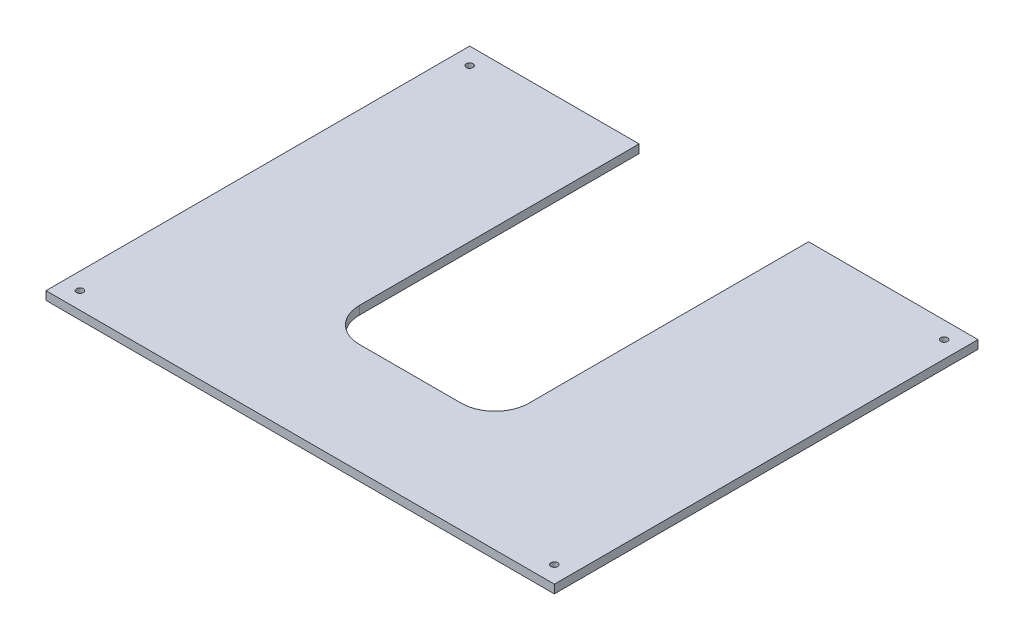
ISO-10303-21;
HEADER;
FILE_DESCRIPTION(('STEP AP214'),'2;1');
FILE_NAME('part.step','',(''),(''),'','','');
FILE_SCHEMA(('AUTOMOTIVE_DESIGN { 1 0 10303 214 1 1 1 1 }'));
ENDSEC;
DATA;
#1=APPLICATION_CONTEXT('core data for automotive mechanical design processes');
#2=APPLICATION_PROTOCOL_DEFINITION('international standard','automotive_design',2000,#1);
#3=PRODUCT_CONTEXT('',#1,'mechanical');
#4=PRODUCT('Part','Part','',(#3));
#5=PRODUCT_RELATED_PRODUCT_CATEGORY('part','',(#4));
#6=PRODUCT_DEFINITION_FORMATION('','',#4);
#7=PRODUCT_DEFINITION_CONTEXT('part definition',#1,'design');
#8=PRODUCT_DEFINITION('design','',#6,#7);
#9=PRODUCT_DEFINITION_SHAPE('','',#8);
#10=(LENGTH_UNIT() NAMED_UNIT(*) SI_UNIT(.MILLI.,.METRE.));
#11=(NAMED_UNIT(*) PLANE_ANGLE_UNIT() SI_UNIT($,.RADIAN.));
#12=(NAMED_UNIT(*) SI_UNIT($,.STERADIAN.) SOLID_ANGLE_UNIT());
#13=UNCERTAINTY_MEASURE_WITH_UNIT(LENGTH_MEASURE(1.E-05),#10,'distance_accuracy_value','');
#14=(GEOMETRIC_REPRESENTATION_CONTEXT(3) GLOBAL_UNCERTAINTY_ASSIGNED_CONTEXT((#13)) GLOBAL_UNIT_ASSIGNED_CONTEXT((#10,
#11,#12)) REPRESENTATION_CONTEXT('',''));
#15=CARTESIAN_POINT('',(0.,0.,0.));
#16=DIRECTION('',(0.,0.,1.));
#17=DIRECTION('',(1.,0.,0.));
#18=AXIS2_PLACEMENT_3D('',#15,#16,#17);
#19=CARTESIAN_POINT('',(-150.,5.,-125.));
#20=DIRECTION('',(0.,0.,1.));
#21=DIRECTION('',(1.,0.,0.));
#22=AXIS2_PLACEMENT_3D('',#19,#20,#21);
#23=PLANE('',#22);
#24=DIRECTION('',(-1.,0.,0.));
#25=VECTOR('',#24,1.);
#26=CARTESIAN_POINT('',(-150.,5.,-125.));
#27=LINE('',#26,#25);
#28=CARTESIAN_POINT('',(-50.,5.,-125.));
#29=VERTEX_POINT('',#28);
#30=CARTESIAN_POINT('',(-150.,5.,-125.));
#31=VERTEX_POINT('',#30);
#32=EDGE_CURVE('E202',#29,#31,#27,.T.);
#33=ORIENTED_EDGE('',*,*,#32,.F.);
#34=DIRECTION('',(0.,1.,0.));
#35=VECTOR('',#34,1.);
#36=CARTESIAN_POINT('',(-50.,0.,-125.));
#37=LINE('',#36,#35);
#38=CARTESIAN_POINT('',(-50.,0.,-125.));
#39=VERTEX_POINT('',#38);
#40=EDGE_CURVE('E139',#39,#29,#37,.T.);
#41=ORIENTED_EDGE('',*,*,#40,.F.);
#42=DIRECTION('',(-1.,0.,0.));
#43=VECTOR('',#42,1.);
#44=CARTESIAN_POINT('',(-150.,0.,-125.));
#45=LINE('',#44,#43);
#46=CARTESIAN_POINT('',(-150.,0.,-125.));
#47=VERTEX_POINT('',#46);
#48=EDGE_CURVE('E146',#39,#47,#45,.T.);
#49=ORIENTED_EDGE('',*,*,#48,.T.);
#50=DIRECTION('',(0.,-1.,0.));
#51=VECTOR('',#50,1.);
#52=CARTESIAN_POINT('',(-150.,5.,-125.));
#53=LINE('',#52,#51);
#54=EDGE_CURVE('E163',#31,#47,#53,.T.);
#55=ORIENTED_EDGE('',*,*,#54,.F.);
#56=EDGE_LOOP('',(#33,#41,#49,#55));
#57=FACE_BOUND('',#56,.T.);
#58=ADVANCED_FACE('F41',(#57),#23,.F.);
#59=CARTESIAN_POINT('',(0.,5.,0.));
#60=DIRECTION('',(0.,-1.,0.));
#61=DIRECTION('',(0.,0.,-1.));
#62=AXIS2_PLACEMENT_3D('',#59,#60,#61);
#63=PLANE('',#62);
#64=DIRECTION('',(1.,0.,0.));
#65=VECTOR('',#64,1.);
#66=CARTESIAN_POINT('',(-50.,5.,60.));
#67=LINE('',#66,#65);
#68=CARTESIAN_POINT('',(-30.,5.,60.));
#69=VERTEX_POINT('',#68);
#70=CARTESIAN_POINT('',(30.,5.,60.));
#71=VERTEX_POINT('',#70);
#72=EDGE_CURVE('E249',#69,#71,#67,.T.);
#73=ORIENTED_EDGE('',*,*,#72,.F.);
#74=CARTESIAN_POINT('',(-30.,5.,40.));
#75=DIRECTION('',(0.,-1.,0.));
#76=DIRECTION('',(0.,0.,-1.));
#77=AXIS2_PLACEMENT_3D('',#74,#75,#76);
#78=CIRCLE('',#77,20.);
#79=CARTESIAN_POINT('',(-50.,5.,40.));
#80=VERTEX_POINT('',#79);
#81=EDGE_CURVE('E49',#69,#80,#78,.T.);
#82=ORIENTED_EDGE('',*,*,#81,.T.);
#83=DIRECTION('',(0.,0.,1.));
#84=VECTOR('',#83,1.);
#85=CARTESIAN_POINT('',(-50.,5.,-125.));
#86=LINE('',#85,#84);
#87=EDGE_CURVE('E225',#29,#80,#86,.T.);
#88=ORIENTED_EDGE('',*,*,#87,.F.);
#89=ORIENTED_EDGE('',*,*,#32,.T.);
#90=DIRECTION('',(0.,0.,1.));
#91=VECTOR('',#90,1.);
#92=CARTESIAN_POINT('',(-150.,5.,125.));
#93=LINE('',#92,#91);
#94=CARTESIAN_POINT('',(-150.,5.,125.));
#95=VERTEX_POINT('',#94);
#96=EDGE_CURVE('E212',#31,#95,#93,.T.);
#97=ORIENTED_EDGE('',*,*,#96,.T.);
#98=DIRECTION('',(1.,0.,0.));
#99=VECTOR('',#98,1.);
#100=CARTESIAN_POINT('',(-150.,5.,125.));
#101=LINE('',#100,#99);
#102=CARTESIAN_POINT('',(150.,5.,125.));
#103=VERTEX_POINT('',#102);
#104=EDGE_CURVE('E160',#95,#103,#101,.T.);
#105=ORIENTED_EDGE('',*,*,#104,.T.);
#106=DIRECTION('',(0.,0.,-1.));
#107=VECTOR('',#106,1.);
#108=CARTESIAN_POINT('',(150.,5.,125.));
#109=LINE('',#108,#107);
#110=CARTESIAN_POINT('',(150.,5.,-125.));
#111=VERTEX_POINT('',#110);
#112=EDGE_CURVE('E155',#103,#111,#109,.T.);
#113=ORIENTED_EDGE('',*,*,#112,.T.);
#114=CARTESIAN_POINT('',(50.,5.,-125.));
#115=VERTEX_POINT('',#114);
#116=EDGE_CURVE('E203',#111,#115,#27,.T.);
#117=ORIENTED_EDGE('',*,*,#116,.T.);
#118=DIRECTION('',(0.,0.,-1.));
#119=VECTOR('',#118,1.);
#120=CARTESIAN_POINT('',(50.,5.,-125.));
#121=LINE('',#120,#119);
#122=CARTESIAN_POINT('',(50.,5.,40.));
#123=VERTEX_POINT('',#122);
#124=EDGE_CURVE('E136',#123,#115,#121,.T.);
#125=ORIENTED_EDGE('',*,*,#124,.F.);
#126=CARTESIAN_POINT('',(30.,5.,40.));
#127=DIRECTION('',(0.,-1.,0.));
#128=DIRECTION('',(0.,0.,-1.));
#129=AXIS2_PLACEMENT_3D('',#126,#127,#128);
#130=CIRCLE('',#129,20.);
#131=EDGE_CURVE('E175',#123,#71,#130,.T.);
#132=ORIENTED_EDGE('',*,*,#131,.T.);
#133=EDGE_LOOP('',(#73,#82,#88,#89,#97,#105,#113,#117,#125,#132));
#134=FACE_BOUND('',#133,.T.);
#135=CARTESIAN_POINT('',(-140.,5.,115.));
#136=DIRECTION('',(0.,1.,0.));
#137=DIRECTION('',(0.,0.,1.));
#138=AXIS2_PLACEMENT_3D('',#135,#136,#137);
#139=CIRCLE('',#138,2.);
#140=CARTESIAN_POINT('',(-140.,5.,117.));
#141=VERTEX_POINT('',#140);
#142=EDGE_CURVE('E187',#141,#141,#139,.T.);
#143=ORIENTED_EDGE('',*,*,#142,.F.);
#144=EDGE_LOOP('',(#143));
#145=FACE_BOUND('',#144,.T.);
#146=CARTESIAN_POINT('',(-140.,5.,-115.));
#147=DIRECTION('',(0.,1.,0.));
#148=DIRECTION('',(0.,0.,-1.));
#149=AXIS2_PLACEMENT_3D('',#146,#147,#148);
#150=CIRCLE('',#149,2.);
#151=CARTESIAN_POINT('',(-140.,5.,-117.));
#152=VERTEX_POINT('',#151);
#153=EDGE_CURVE('E197',#152,#152,#150,.T.);
#154=ORIENTED_EDGE('',*,*,#153,.F.);
#155=EDGE_LOOP('',(#154));
#156=FACE_BOUND('',#155,.T.);
#157=CARTESIAN_POINT('',(140.,5.,115.));
#158=DIRECTION('',(0.,1.,0.));
#159=DIRECTION('',(0.,0.,-1.));
#160=AXIS2_PLACEMENT_3D('',#157,#158,#159);
#161=CIRCLE('',#160,2.);
#162=CARTESIAN_POINT('',(140.,5.,113.));
#163=VERTEX_POINT('',#162);
#164=EDGE_CURVE('E272',#163,#163,#161,.T.);
#165=ORIENTED_EDGE('',*,*,#164,.F.);
#166=EDGE_LOOP('',(#165));
#167=FACE_BOUND('',#166,.T.);
#168=CARTESIAN_POINT('',(140.,5.,-115.));
#169=DIRECTION('',(0.,1.,0.));
#170=DIRECTION('',(0.,0.,1.));
#171=AXIS2_PLACEMENT_3D('',#168,#169,#170);
#172=CIRCLE('',#171,2.);
#173=CARTESIAN_POINT('',(140.,5.,-113.));
#174=VERTEX_POINT('',#173);
#175=EDGE_CURVE('E264',#174,#174,#172,.T.);
#176=ORIENTED_EDGE('',*,*,#175,.F.);
#177=EDGE_LOOP('',(#176));
#178=FACE_BOUND('',#177,.T.);
#179=ADVANCED_FACE('F223',(#134,#145,#156,#167,#178),#63,.F.);
#180=CARTESIAN_POINT('',(0.,0.,0.));
#181=DIRECTION('',(0.,-1.,0.));
#182=DIRECTION('',(0.,0.,-1.));
#183=AXIS2_PLACEMENT_3D('',#180,#181,#182);
#184=PLANE('',#183);
#185=DIRECTION('',(0.,0.,1.));
#186=VECTOR('',#185,1.);
#187=CARTESIAN_POINT('',(-50.,0.,-125.));
#188=LINE('',#187,#186);
#189=CARTESIAN_POINT('',(-50.,0.,40.));
#190=VERTEX_POINT('',#189);
#191=EDGE_CURVE('E240',#39,#190,#188,.T.);
#192=ORIENTED_EDGE('',*,*,#191,.T.);
#193=CARTESIAN_POINT('',(-30.,0.,40.));
#194=DIRECTION('',(0.,-1.,0.));
#195=DIRECTION('',(0.,0.,-1.));
#196=AXIS2_PLACEMENT_3D('',#193,#194,#195);
#197=CIRCLE('',#196,20.);
#198=CARTESIAN_POINT('',(-30.,0.,60.));
#199=VERTEX_POINT('',#198);
#200=EDGE_CURVE('E12',#190,#199,#197,.F.);
#201=ORIENTED_EDGE('',*,*,#200,.T.);
#202=DIRECTION('',(1.,0.,0.));
#203=VECTOR('',#202,1.);
#204=CARTESIAN_POINT('',(-50.,0.,60.));
#205=LINE('',#204,#203);
#206=CARTESIAN_POINT('',(30.,0.,60.));
#207=VERTEX_POINT('',#206);
#208=EDGE_CURVE('E131',#199,#207,#205,.T.);
#209=ORIENTED_EDGE('',*,*,#208,.T.);
#210=CARTESIAN_POINT('',(30.,0.,40.));
#211=DIRECTION('',(0.,-1.,0.));
#212=DIRECTION('',(0.,0.,-1.));
#213=AXIS2_PLACEMENT_3D('',#210,#211,#212);
#214=CIRCLE('',#213,20.);
#215=CARTESIAN_POINT('',(50.,0.,40.));
#216=VERTEX_POINT('',#215);
#217=EDGE_CURVE('E126',#207,#216,#214,.F.);
#218=ORIENTED_EDGE('',*,*,#217,.T.);
#219=DIRECTION('',(0.,0.,-1.));
#220=VECTOR('',#219,1.);
#221=CARTESIAN_POINT('',(50.,0.,-125.));
#222=LINE('',#221,#220);
#223=CARTESIAN_POINT('',(50.,0.,-125.));
#224=VERTEX_POINT('',#223);
#225=EDGE_CURVE('E116',#216,#224,#222,.T.);
#226=ORIENTED_EDGE('',*,*,#225,.T.);
#227=CARTESIAN_POINT('',(150.,0.,-125.));
#228=VERTEX_POINT('',#227);
#229=EDGE_CURVE('E122',#228,#224,#45,.T.);
#230=ORIENTED_EDGE('',*,*,#229,.F.);
#231=DIRECTION('',(0.,0.,-1.));
#232=VECTOR('',#231,1.);
#233=CARTESIAN_POINT('',(150.,0.,125.));
#234=LINE('',#233,#232);
#235=CARTESIAN_POINT('',(150.,0.,125.));
#236=VERTEX_POINT('',#235);
#237=EDGE_CURVE('E150',#236,#228,#234,.T.);
#238=ORIENTED_EDGE('',*,*,#237,.F.);
#239=DIRECTION('',(1.,0.,0.));
#240=VECTOR('',#239,1.);
#241=CARTESIAN_POINT('',(-150.,0.,125.));
#242=LINE('',#241,#240);
#243=CARTESIAN_POINT('',(-150.,0.,125.));
#244=VERTEX_POINT('',#243);
#245=EDGE_CURVE('E148',#244,#236,#242,.T.);
#246=ORIENTED_EDGE('',*,*,#245,.F.);
#247=DIRECTION('',(0.,0.,1.));
#248=VECTOR('',#247,1.);
#249=CARTESIAN_POINT('',(-150.,0.,125.));
#250=LINE('',#249,#248);
#251=EDGE_CURVE('E145',#47,#244,#250,.T.);
#252=ORIENTED_EDGE('',*,*,#251,.F.);
#253=ORIENTED_EDGE('',*,*,#48,.F.);
#254=EDGE_LOOP('',(#192,#201,#209,#218,#226,#230,#238,#246,#252,#253));
#255=FACE_BOUND('',#254,.T.);
#256=CARTESIAN_POINT('',(140.,0.,115.));
#257=DIRECTION('',(0.,1.,0.));
#258=DIRECTION('',(0.,0.,-1.));
#259=AXIS2_PLACEMENT_3D('',#256,#257,#258);
#260=CIRCLE('',#259,2.);
#261=CARTESIAN_POINT('',(140.,0.,113.));
#262=VERTEX_POINT('',#261);
#263=EDGE_CURVE('E269',#262,#262,#260,.T.);
#264=ORIENTED_EDGE('',*,*,#263,.T.);
#265=EDGE_LOOP('',(#264));
#266=FACE_BOUND('',#265,.T.);
#267=CARTESIAN_POINT('',(-140.,0.,115.));
#268=DIRECTION('',(0.,1.,0.));
#269=DIRECTION('',(0.,0.,1.));
#270=AXIS2_PLACEMENT_3D('',#267,#268,#269);
#271=CIRCLE('',#270,2.);
#272=CARTESIAN_POINT('',(-140.,0.,117.));
#273=VERTEX_POINT('',#272);
#274=EDGE_CURVE('E193',#273,#273,#271,.T.);
#275=ORIENTED_EDGE('',*,*,#274,.T.);
#276=EDGE_LOOP('',(#275));
#277=FACE_BOUND('',#276,.T.);
#278=CARTESIAN_POINT('',(-140.,0.,-115.));
#279=DIRECTION('',(0.,1.,0.));
#280=DIRECTION('',(0.,0.,-1.));
#281=AXIS2_PLACEMENT_3D('',#278,#279,#280);
#282=CIRCLE('',#281,2.);
#283=CARTESIAN_POINT('',(-140.,0.,-117.));
#284=VERTEX_POINT('',#283);
#285=EDGE_CURVE('E194',#284,#284,#282,.T.);
#286=ORIENTED_EDGE('',*,*,#285,.T.);
#287=EDGE_LOOP('',(#286));
#288=FACE_BOUND('',#287,.T.);
#289=CARTESIAN_POINT('',(140.,0.,-115.));
#290=DIRECTION('',(0.,1.,0.));
#291=DIRECTION('',(0.,0.,1.));
#292=AXIS2_PLACEMENT_3D('',#289,#290,#291);
#293=CIRCLE('',#292,2.);
#294=CARTESIAN_POINT('',(140.,0.,-113.));
#295=VERTEX_POINT('',#294);
#296=EDGE_CURVE('E263',#295,#295,#293,.T.);
#297=ORIENTED_EDGE('',*,*,#296,.T.);
#298=EDGE_LOOP('',(#297));
#299=FACE_BOUND('',#298,.T.);
#300=ADVANCED_FACE('F118',(#255,#266,#277,#288,#299),#184,.T.);
#301=CARTESIAN_POINT('',(150.,5.,125.));
#302=DIRECTION('',(-1.,0.,0.));
#303=DIRECTION('',(0.,0.,1.));
#304=AXIS2_PLACEMENT_3D('',#301,#302,#303);
#305=PLANE('',#304);
#306=ORIENTED_EDGE('',*,*,#237,.T.);
#307=DIRECTION('',(0.,-1.,0.));
#308=VECTOR('',#307,1.);
#309=CARTESIAN_POINT('',(150.,5.,-125.));
#310=LINE('',#309,#308);
#311=EDGE_CURVE('E143',#111,#228,#310,.T.);
#312=ORIENTED_EDGE('',*,*,#311,.F.);
#313=ORIENTED_EDGE('',*,*,#112,.F.);
#314=DIRECTION('',(0.,-1.,0.));
#315=VECTOR('',#314,1.);
#316=CARTESIAN_POINT('',(150.,5.,125.));
#317=LINE('',#316,#315);
#318=EDGE_CURVE('E156',#103,#236,#317,.T.);
#319=ORIENTED_EDGE('',*,*,#318,.T.);
#320=EDGE_LOOP('',(#306,#312,#313,#319));
#321=FACE_BOUND('',#320,.T.);
#322=ADVANCED_FACE('F239',(#321),#305,.F.);
#323=ORIENTED_EDGE('',*,*,#229,.T.);
#324=DIRECTION('',(0.,1.,0.));
#325=VECTOR('',#324,1.);
#326=CARTESIAN_POINT('',(50.,0.,-125.));
#327=LINE('',#326,#325);
#328=EDGE_CURVE('E130',#224,#115,#327,.T.);
#329=ORIENTED_EDGE('',*,*,#328,.T.);
#330=ORIENTED_EDGE('',*,*,#116,.F.);
#331=ORIENTED_EDGE('',*,*,#311,.T.);
#332=EDGE_LOOP('',(#323,#329,#330,#331));
#333=FACE_BOUND('',#332,.T.);
#334=ADVANCED_FACE('F141',(#333),#23,.F.);
#335=CARTESIAN_POINT('',(-150.,5.,125.));
#336=DIRECTION('',(1.,0.,0.));
#337=DIRECTION('',(0.,0.,-1.));
#338=AXIS2_PLACEMENT_3D('',#335,#336,#337);
#339=PLANE('',#338);
#340=ORIENTED_EDGE('',*,*,#251,.T.);
#341=DIRECTION('',(0.,-1.,0.));
#342=VECTOR('',#341,1.);
#343=CARTESIAN_POINT('',(-150.,5.,125.));
#344=LINE('',#343,#342);
#345=EDGE_CURVE('E159',#95,#244,#344,.T.);
#346=ORIENTED_EDGE('',*,*,#345,.F.);
#347=ORIENTED_EDGE('',*,*,#96,.F.);
#348=ORIENTED_EDGE('',*,*,#54,.T.);
#349=EDGE_LOOP('',(#340,#346,#347,#348));
#350=FACE_BOUND('',#349,.T.);
#351=ADVANCED_FACE('F231',(#350),#339,.F.);
#352=CARTESIAN_POINT('',(-150.,5.,125.));
#353=DIRECTION('',(0.,0.,-1.));
#354=DIRECTION('',(-1.,0.,0.));
#355=AXIS2_PLACEMENT_3D('',#352,#353,#354);
#356=PLANE('',#355);
#357=ORIENTED_EDGE('',*,*,#245,.T.);
#358=ORIENTED_EDGE('',*,*,#318,.F.);
#359=ORIENTED_EDGE('',*,*,#104,.F.);
#360=ORIENTED_EDGE('',*,*,#345,.T.);
#361=EDGE_LOOP('',(#357,#358,#359,#360));
#362=FACE_BOUND('',#361,.T.);
#363=ADVANCED_FACE('F236',(#362),#356,.F.);
#364=CARTESIAN_POINT('',(-140.,5.,115.));
#365=DIRECTION('',(0.,-1.,0.));
#366=DIRECTION('',(0.,0.,-1.));
#367=AXIS2_PLACEMENT_3D('',#364,#365,#366);
#368=CYLINDRICAL_SURFACE('',#367,2.);
#369=ORIENTED_EDGE('',*,*,#142,.T.);
#370=EDGE_LOOP('',(#369));
#371=FACE_BOUND('',#370,.T.);
#372=ORIENTED_EDGE('',*,*,#274,.F.);
#373=EDGE_LOOP('',(#372));
#374=FACE_BOUND('',#373,.T.);
#375=ADVANCED_FACE('F291',(#371,#374),#368,.F.);
#376=CARTESIAN_POINT('',(-140.,5.,-115.));
#377=DIRECTION('',(0.,-1.,0.));
#378=DIRECTION('',(0.,0.,-1.));
#379=AXIS2_PLACEMENT_3D('',#376,#377,#378);
#380=CYLINDRICAL_SURFACE('',#379,2.);
#381=ORIENTED_EDGE('',*,*,#153,.T.);
#382=EDGE_LOOP('',(#381));
#383=FACE_BOUND('',#382,.T.);
#384=ORIENTED_EDGE('',*,*,#285,.F.);
#385=EDGE_LOOP('',(#384));
#386=FACE_BOUND('',#385,.T.);
#387=ADVANCED_FACE('F288',(#383,#386),#380,.F.);
#388=CARTESIAN_POINT('',(140.,5.,115.));
#389=DIRECTION('',(0.,-1.,0.));
#390=DIRECTION('',(0.,0.,-1.));
#391=AXIS2_PLACEMENT_3D('',#388,#389,#390);
#392=CYLINDRICAL_SURFACE('',#391,2.);
#393=ORIENTED_EDGE('',*,*,#164,.T.);
#394=EDGE_LOOP('',(#393));
#395=FACE_BOUND('',#394,.T.);
#396=ORIENTED_EDGE('',*,*,#263,.F.);
#397=EDGE_LOOP('',(#396));
#398=FACE_BOUND('',#397,.T.);
#399=ADVANCED_FACE('F290',(#395,#398),#392,.F.);
#400=CARTESIAN_POINT('',(140.,5.,-115.));
#401=DIRECTION('',(0.,-1.,0.));
#402=DIRECTION('',(0.,0.,-1.));
#403=AXIS2_PLACEMENT_3D('',#400,#401,#402);
#404=CYLINDRICAL_SURFACE('',#403,2.);
#405=ORIENTED_EDGE('',*,*,#175,.T.);
#406=EDGE_LOOP('',(#405));
#407=FACE_BOUND('',#406,.T.);
#408=ORIENTED_EDGE('',*,*,#296,.F.);
#409=EDGE_LOOP('',(#408));
#410=FACE_BOUND('',#409,.T.);
#411=ADVANCED_FACE('F297',(#407,#410),#404,.F.);
#412=CARTESIAN_POINT('',(-50.,0.,-125.));
#413=DIRECTION('',(-1.,0.,0.));
#414=DIRECTION('',(0.,0.,1.));
#415=AXIS2_PLACEMENT_3D('',#412,#413,#414);
#416=PLANE('',#415);
#417=ORIENTED_EDGE('',*,*,#87,.T.);
#418=DIRECTION('',(0.,1.,0.));
#419=VECTOR('',#418,1.);
#420=CARTESIAN_POINT('',(-50.,0.,40.));
#421=LINE('',#420,#419);
#422=EDGE_CURVE('E56',#80,#190,#421,.F.);
#423=ORIENTED_EDGE('',*,*,#422,.T.);
#424=ORIENTED_EDGE('',*,*,#191,.F.);
#425=ORIENTED_EDGE('',*,*,#40,.T.);
#426=EDGE_LOOP('',(#417,#423,#424,#425));
#427=FACE_BOUND('',#426,.T.);
#428=ADVANCED_FACE('F331',(#427),#416,.F.);
#429=CARTESIAN_POINT('',(50.,0.,-125.));
#430=DIRECTION('',(1.,0.,0.));
#431=DIRECTION('',(0.,0.,-1.));
#432=AXIS2_PLACEMENT_3D('',#429,#430,#431);
#433=PLANE('',#432);
#434=ORIENTED_EDGE('',*,*,#225,.F.);
#435=DIRECTION('',(0.,1.,0.));
#436=VECTOR('',#435,1.);
#437=CARTESIAN_POINT('',(50.,5.,40.));
#438=LINE('',#437,#436);
#439=EDGE_CURVE('E167',#216,#123,#438,.T.);
#440=ORIENTED_EDGE('',*,*,#439,.T.);
#441=ORIENTED_EDGE('',*,*,#124,.T.);
#442=ORIENTED_EDGE('',*,*,#328,.F.);
#443=EDGE_LOOP('',(#434,#440,#441,#442));
#444=FACE_BOUND('',#443,.T.);
#445=ADVANCED_FACE('F134',(#444),#433,.F.);
#446=CARTESIAN_POINT('',(-50.,0.,60.));
#447=DIRECTION('',(0.,0.,1.));
#448=DIRECTION('',(1.,0.,0.));
#449=AXIS2_PLACEMENT_3D('',#446,#447,#448);
#450=PLANE('',#449);
#451=ORIENTED_EDGE('',*,*,#72,.T.);
#452=DIRECTION('',(0.,1.,0.));
#453=VECTOR('',#452,1.);
#454=CARTESIAN_POINT('',(30.,0.,60.));
#455=LINE('',#454,#453);
#456=EDGE_CURVE('E172',#71,#207,#455,.F.);
#457=ORIENTED_EDGE('',*,*,#456,.T.);
#458=ORIENTED_EDGE('',*,*,#208,.F.);
#459=DIRECTION('',(0.,1.,0.));
#460=VECTOR('',#459,1.);
#461=CARTESIAN_POINT('',(-30.,5.,60.));
#462=LINE('',#461,#460);
#463=EDGE_CURVE('E169',#199,#69,#462,.T.);
#464=ORIENTED_EDGE('',*,*,#463,.T.);
#465=EDGE_LOOP('',(#451,#457,#458,#464));
#466=FACE_BOUND('',#465,.T.);
#467=ADVANCED_FACE('F248',(#466),#450,.F.);
#468=CARTESIAN_POINT('',(30.,0.,40.));
#469=DIRECTION('',(0.,-1.,0.));
#470=DIRECTION('',(0.,0.,-1.));
#471=AXIS2_PLACEMENT_3D('',#468,#469,#470);
#472=CYLINDRICAL_SURFACE('',#471,20.);
#473=ORIENTED_EDGE('',*,*,#217,.F.);
#474=ORIENTED_EDGE('',*,*,#456,.F.);
#475=ORIENTED_EDGE('',*,*,#131,.F.);
#476=ORIENTED_EDGE('',*,*,#439,.F.);
#477=EDGE_LOOP('',(#473,#474,#475,#476));
#478=FACE_BOUND('',#477,.T.);
#479=ADVANCED_FACE('F319',(#478),#472,.F.);
#480=CARTESIAN_POINT('',(-30.,0.,40.));
#481=DIRECTION('',(0.,-1.,0.));
#482=DIRECTION('',(0.,0.,-1.));
#483=AXIS2_PLACEMENT_3D('',#480,#481,#482);
#484=CYLINDRICAL_SURFACE('',#483,20.);
#485=ORIENTED_EDGE('',*,*,#200,.F.);
#486=ORIENTED_EDGE('',*,*,#422,.F.);
#487=ORIENTED_EDGE('',*,*,#81,.F.);
#488=ORIENTED_EDGE('',*,*,#463,.F.);
#489=EDGE_LOOP('',(#485,#486,#487,#488));
#490=FACE_BOUND('',#489,.T.);
#491=ADVANCED_FACE('F43',(#490),#484,.F.);
#492=CLOSED_SHELL('',(#58,#179,#300,#322,#334,#351,#363,#375,#387,#399,#411,#428,#445,#467,#479,#491));
#493=MANIFOLD_SOLID_BREP('B2',#492);
#494=ADVANCED_BREP_SHAPE_REPRESENTATION('',(#18,#493),#14);
#495=SHAPE_DEFINITION_REPRESENTATION(#9,#494);
ENDSEC;
END-ISO-10303-21;
